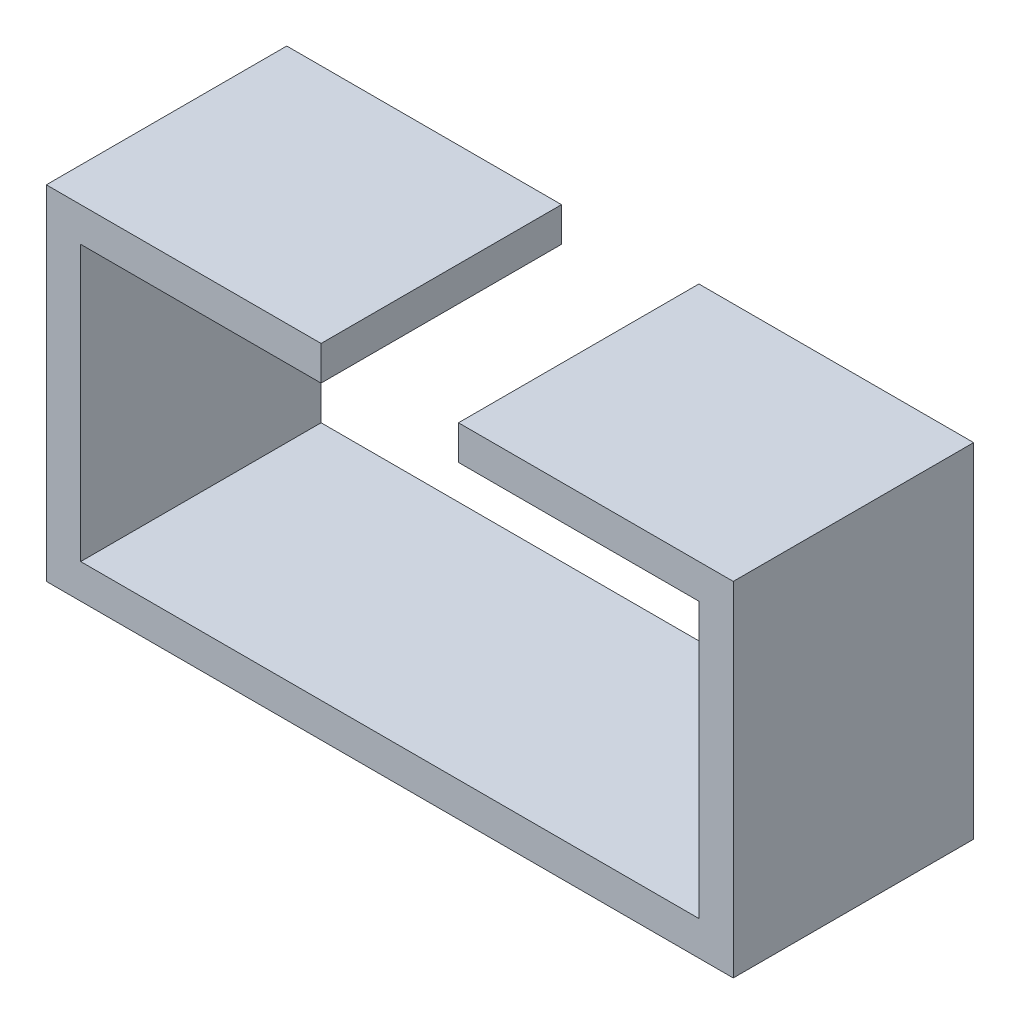
ISO-10303-21;
HEADER;
FILE_DESCRIPTION(('STEP AP214'),'2;1');
FILE_NAME('part.step','',(''),(''),'','','');
FILE_SCHEMA(('AUTOMOTIVE_DESIGN { 1 0 10303 214 1 1 1 1 }'));
ENDSEC;
DATA;
#1=APPLICATION_CONTEXT('core data for automotive mechanical design processes');
#2=APPLICATION_PROTOCOL_DEFINITION('international standard','automotive_design',2000,#1);
#3=PRODUCT_CONTEXT('',#1,'mechanical');
#4=PRODUCT('Part','Part','',(#3));
#5=PRODUCT_RELATED_PRODUCT_CATEGORY('part','',(#4));
#6=PRODUCT_DEFINITION_FORMATION('','',#4);
#7=PRODUCT_DEFINITION_CONTEXT('part definition',#1,'design');
#8=PRODUCT_DEFINITION('design','',#6,#7);
#9=PRODUCT_DEFINITION_SHAPE('','',#8);
#10=(LENGTH_UNIT() NAMED_UNIT(*) SI_UNIT(.MILLI.,.METRE.));
#11=(NAMED_UNIT(*) PLANE_ANGLE_UNIT() SI_UNIT($,.RADIAN.));
#12=(NAMED_UNIT(*) SI_UNIT($,.STERADIAN.) SOLID_ANGLE_UNIT());
#13=UNCERTAINTY_MEASURE_WITH_UNIT(LENGTH_MEASURE(1.E-05),#10,'distance_accuracy_value','');
#14=(GEOMETRIC_REPRESENTATION_CONTEXT(3) GLOBAL_UNCERTAINTY_ASSIGNED_CONTEXT((#13)) GLOBAL_UNIT_ASSIGNED_CONTEXT((#10,
#11,#12)) REPRESENTATION_CONTEXT('',''));
#15=CARTESIAN_POINT('',(0.,0.,0.));
#16=DIRECTION('',(0.,0.,1.));
#17=DIRECTION('',(1.,0.,0.));
#18=AXIS2_PLACEMENT_3D('',#15,#16,#17);
#19=CARTESIAN_POINT('',(-22.86,10.16,17.78));
#20=DIRECTION('',(-1.,0.,0.));
#21=DIRECTION('',(0.,0.,1.));
#22=AXIS2_PLACEMENT_3D('',#19,#20,#21);
#23=PLANE('',#22);
#24=DIRECTION('',(0.,1.,0.));
#25=VECTOR('',#24,1.);
#26=CARTESIAN_POINT('',(-22.86,10.16,0.));
#27=LINE('',#26,#25);
#28=CARTESIAN_POINT('',(-22.86,-10.16,0.));
#29=VERTEX_POINT('',#28);
#30=CARTESIAN_POINT('',(-22.86,10.16,0.));
#31=VERTEX_POINT('',#30);
#32=EDGE_CURVE('E164',#29,#31,#27,.T.);
#33=ORIENTED_EDGE('',*,*,#32,.T.);
#34=DIRECTION('',(0.,0.,-1.));
#35=VECTOR('',#34,1.);
#36=CARTESIAN_POINT('',(-22.86,10.16,17.78));
#37=LINE('',#36,#35);
#38=CARTESIAN_POINT('',(-22.86,10.16,17.78));
#39=VERTEX_POINT('',#38);
#40=EDGE_CURVE('E11',#39,#31,#37,.T.);
#41=ORIENTED_EDGE('',*,*,#40,.F.);
#42=DIRECTION('',(0.,1.,0.));
#43=VECTOR('',#42,1.);
#44=CARTESIAN_POINT('',(-22.86,10.16,17.78));
#45=LINE('',#44,#43);
#46=CARTESIAN_POINT('',(-22.86,-10.16,17.78));
#47=VERTEX_POINT('',#46);
#48=EDGE_CURVE('E198',#47,#39,#45,.T.);
#49=ORIENTED_EDGE('',*,*,#48,.F.);
#50=DIRECTION('',(0.,0.,-1.));
#51=VECTOR('',#50,1.);
#52=CARTESIAN_POINT('',(-22.86,-10.16,17.78));
#53=LINE('',#52,#51);
#54=EDGE_CURVE('E160',#47,#29,#53,.T.);
#55=ORIENTED_EDGE('',*,*,#54,.T.);
#56=EDGE_LOOP('',(#33,#41,#49,#55));
#57=FACE_BOUND('',#56,.T.);
#58=ADVANCED_FACE('F39',(#57),#23,.F.);
#59=CARTESIAN_POINT('',(-22.86,10.16,17.78));
#60=DIRECTION('',(0.,1.,0.));
#61=DIRECTION('',(0.,0.,1.));
#62=AXIS2_PLACEMENT_3D('',#59,#60,#61);
#63=PLANE('',#62);
#64=DIRECTION('',(1.,0.,0.));
#65=VECTOR('',#64,1.);
#66=CARTESIAN_POINT('',(-22.86,10.16,0.));
#67=LINE('',#66,#65);
#68=CARTESIAN_POINT('',(-5.08,10.16,0.));
#69=VERTEX_POINT('',#68);
#70=EDGE_CURVE('E168',#31,#69,#67,.T.);
#71=ORIENTED_EDGE('',*,*,#70,.T.);
#72=DIRECTION('',(0.,0.,-1.));
#73=VECTOR('',#72,1.);
#74=CARTESIAN_POINT('',(-5.08,10.16,17.78));
#75=LINE('',#74,#73);
#76=CARTESIAN_POINT('',(-5.08,10.16,17.78));
#77=VERTEX_POINT('',#76);
#78=EDGE_CURVE('E48',#77,#69,#75,.T.);
#79=ORIENTED_EDGE('',*,*,#78,.F.);
#80=DIRECTION('',(1.,0.,0.));
#81=VECTOR('',#80,1.);
#82=CARTESIAN_POINT('',(-22.86,10.16,17.78));
#83=LINE('',#82,#81);
#84=EDGE_CURVE('E111',#39,#77,#83,.T.);
#85=ORIENTED_EDGE('',*,*,#84,.F.);
#86=ORIENTED_EDGE('',*,*,#40,.T.);
#87=EDGE_LOOP('',(#71,#79,#85,#86));
#88=FACE_BOUND('',#87,.T.);
#89=ADVANCED_FACE('F292',(#88),#63,.F.);
#90=CARTESIAN_POINT('',(-5.08,12.7,17.78));
#91=DIRECTION('',(-1.,0.,0.));
#92=DIRECTION('',(0.,0.,1.));
#93=AXIS2_PLACEMENT_3D('',#90,#91,#92);
#94=PLANE('',#93);
#95=DIRECTION('',(0.,1.,0.));
#96=VECTOR('',#95,1.);
#97=CARTESIAN_POINT('',(-5.08,12.7,0.));
#98=LINE('',#97,#96);
#99=CARTESIAN_POINT('',(-5.08,12.7,0.));
#100=VERTEX_POINT('',#99);
#101=EDGE_CURVE('E171',#69,#100,#98,.T.);
#102=ORIENTED_EDGE('',*,*,#101,.T.);
#103=DIRECTION('',(0.,0.,-1.));
#104=VECTOR('',#103,1.);
#105=CARTESIAN_POINT('',(-5.08,12.7,17.78));
#106=LINE('',#105,#104);
#107=CARTESIAN_POINT('',(-5.08,12.7,17.78));
#108=VERTEX_POINT('',#107);
#109=EDGE_CURVE('E225',#108,#100,#106,.T.);
#110=ORIENTED_EDGE('',*,*,#109,.F.);
#111=DIRECTION('',(0.,1.,0.));
#112=VECTOR('',#111,1.);
#113=CARTESIAN_POINT('',(-5.08,12.7,17.78));
#114=LINE('',#113,#112);
#115=EDGE_CURVE('E235',#77,#108,#114,.T.);
#116=ORIENTED_EDGE('',*,*,#115,.F.);
#117=ORIENTED_EDGE('',*,*,#78,.T.);
#118=EDGE_LOOP('',(#102,#110,#116,#117));
#119=FACE_BOUND('',#118,.T.);
#120=ADVANCED_FACE('F233',(#119),#94,.F.);
#121=CARTESIAN_POINT('',(-5.08,12.7,17.78));
#122=DIRECTION('',(0.,-1.,0.));
#123=DIRECTION('',(1.,0.,0.));
#124=AXIS2_PLACEMENT_3D('',#121,#122,#123);
#125=PLANE('',#124);
#126=DIRECTION('',(-1.,0.,0.));
#127=VECTOR('',#126,1.);
#128=CARTESIAN_POINT('',(-5.08,12.7,0.));
#129=LINE('',#128,#127);
#130=CARTESIAN_POINT('',(-25.4,12.7,0.));
#131=VERTEX_POINT('',#130);
#132=EDGE_CURVE('E174',#100,#131,#129,.T.);
#133=ORIENTED_EDGE('',*,*,#132,.T.);
#134=DIRECTION('',(0.,0.,-1.));
#135=VECTOR('',#134,1.);
#136=CARTESIAN_POINT('',(-25.4,12.7,17.78));
#137=LINE('',#136,#135);
#138=CARTESIAN_POINT('',(-25.4,12.7,17.78));
#139=VERTEX_POINT('',#138);
#140=EDGE_CURVE('E221',#139,#131,#137,.T.);
#141=ORIENTED_EDGE('',*,*,#140,.F.);
#142=DIRECTION('',(-1.,0.,0.));
#143=VECTOR('',#142,1.);
#144=CARTESIAN_POINT('',(-5.08,12.7,17.78));
#145=LINE('',#144,#143);
#146=EDGE_CURVE('E254',#108,#139,#145,.T.);
#147=ORIENTED_EDGE('',*,*,#146,.F.);
#148=ORIENTED_EDGE('',*,*,#109,.T.);
#149=EDGE_LOOP('',(#133,#141,#147,#148));
#150=FACE_BOUND('',#149,.T.);
#151=ADVANCED_FACE('F244',(#150),#125,.F.);
#152=CARTESIAN_POINT('',(-25.4,12.7,17.78));
#153=DIRECTION('',(1.,0.,0.));
#154=DIRECTION('',(0.,0.,-1.));
#155=AXIS2_PLACEMENT_3D('',#152,#153,#154);
#156=PLANE('',#155);
#157=DIRECTION('',(0.,-1.,0.));
#158=VECTOR('',#157,1.);
#159=CARTESIAN_POINT('',(-25.4,12.7,0.));
#160=LINE('',#159,#158);
#161=CARTESIAN_POINT('',(-25.4,-12.7,0.));
#162=VERTEX_POINT('',#161);
#163=EDGE_CURVE('E177',#131,#162,#160,.T.);
#164=ORIENTED_EDGE('',*,*,#163,.T.);
#165=DIRECTION('',(0.,0.,-1.));
#166=VECTOR('',#165,1.);
#167=CARTESIAN_POINT('',(-25.4,-12.7,17.78));
#168=LINE('',#167,#166);
#169=CARTESIAN_POINT('',(-25.4,-12.7,17.78));
#170=VERTEX_POINT('',#169);
#171=EDGE_CURVE('E217',#170,#162,#168,.T.);
#172=ORIENTED_EDGE('',*,*,#171,.F.);
#173=DIRECTION('',(0.,-1.,0.));
#174=VECTOR('',#173,1.);
#175=CARTESIAN_POINT('',(-25.4,12.7,17.78));
#176=LINE('',#175,#174);
#177=EDGE_CURVE('E250',#139,#170,#176,.T.);
#178=ORIENTED_EDGE('',*,*,#177,.F.);
#179=ORIENTED_EDGE('',*,*,#140,.T.);
#180=EDGE_LOOP('',(#164,#172,#178,#179));
#181=FACE_BOUND('',#180,.T.);
#182=ADVANCED_FACE('F248',(#181),#156,.F.);
#183=CARTESIAN_POINT('',(25.4,-12.7,17.78));
#184=DIRECTION('',(0.,1.,0.));
#185=DIRECTION('',(0.,0.,1.));
#186=AXIS2_PLACEMENT_3D('',#183,#184,#185);
#187=PLANE('',#186);
#188=DIRECTION('',(1.,0.,0.));
#189=VECTOR('',#188,1.);
#190=CARTESIAN_POINT('',(25.4,-12.7,0.));
#191=LINE('',#190,#189);
#192=CARTESIAN_POINT('',(25.4,-12.7,0.));
#193=VERTEX_POINT('',#192);
#194=EDGE_CURVE('E180',#162,#193,#191,.T.);
#195=ORIENTED_EDGE('',*,*,#194,.T.);
#196=DIRECTION('',(0.,0.,-1.));
#197=VECTOR('',#196,1.);
#198=CARTESIAN_POINT('',(25.4,-12.7,17.78));
#199=LINE('',#198,#197);
#200=CARTESIAN_POINT('',(25.4,-12.7,17.78));
#201=VERTEX_POINT('',#200);
#202=EDGE_CURVE('E213',#201,#193,#199,.T.);
#203=ORIENTED_EDGE('',*,*,#202,.F.);
#204=DIRECTION('',(1.,0.,0.));
#205=VECTOR('',#204,1.);
#206=CARTESIAN_POINT('',(25.4,-12.7,17.78));
#207=LINE('',#206,#205);
#208=EDGE_CURVE('E253',#170,#201,#207,.T.);
#209=ORIENTED_EDGE('',*,*,#208,.F.);
#210=ORIENTED_EDGE('',*,*,#171,.T.);
#211=EDGE_LOOP('',(#195,#203,#209,#210));
#212=FACE_BOUND('',#211,.T.);
#213=ADVANCED_FACE('F305',(#212),#187,.F.);
#214=CARTESIAN_POINT('',(25.4,12.7,17.78));
#215=DIRECTION('',(-1.,0.,0.));
#216=DIRECTION('',(0.,0.,1.));
#217=AXIS2_PLACEMENT_3D('',#214,#215,#216);
#218=PLANE('',#217);
#219=DIRECTION('',(0.,1.,0.));
#220=VECTOR('',#219,1.);
#221=CARTESIAN_POINT('',(25.4,12.7,0.));
#222=LINE('',#221,#220);
#223=CARTESIAN_POINT('',(25.4,12.7,0.));
#224=VERTEX_POINT('',#223);
#225=EDGE_CURVE('E183',#193,#224,#222,.T.);
#226=ORIENTED_EDGE('',*,*,#225,.T.);
#227=DIRECTION('',(0.,0.,-1.));
#228=VECTOR('',#227,1.);
#229=CARTESIAN_POINT('',(25.4,12.7,17.78));
#230=LINE('',#229,#228);
#231=CARTESIAN_POINT('',(25.4,12.7,17.78));
#232=VERTEX_POINT('',#231);
#233=EDGE_CURVE('E209',#232,#224,#230,.T.);
#234=ORIENTED_EDGE('',*,*,#233,.F.);
#235=DIRECTION('',(0.,1.,0.));
#236=VECTOR('',#235,1.);
#237=CARTESIAN_POINT('',(25.4,12.7,17.78));
#238=LINE('',#237,#236);
#239=EDGE_CURVE('E258',#201,#232,#238,.T.);
#240=ORIENTED_EDGE('',*,*,#239,.F.);
#241=ORIENTED_EDGE('',*,*,#202,.T.);
#242=EDGE_LOOP('',(#226,#234,#240,#241));
#243=FACE_BOUND('',#242,.T.);
#244=ADVANCED_FACE('F308',(#243),#218,.F.);
#245=CARTESIAN_POINT('',(25.4,12.7,17.78));
#246=DIRECTION('',(0.,-1.,0.));
#247=DIRECTION('',(1.,0.,0.));
#248=AXIS2_PLACEMENT_3D('',#245,#246,#247);
#249=PLANE('',#248);
#250=DIRECTION('',(-1.,0.,0.));
#251=VECTOR('',#250,1.);
#252=CARTESIAN_POINT('',(25.4,12.7,0.));
#253=LINE('',#252,#251);
#254=CARTESIAN_POINT('',(5.08,12.7,0.));
#255=VERTEX_POINT('',#254);
#256=EDGE_CURVE('E186',#224,#255,#253,.T.);
#257=ORIENTED_EDGE('',*,*,#256,.T.);
#258=DIRECTION('',(0.,0.,-1.));
#259=VECTOR('',#258,1.);
#260=CARTESIAN_POINT('',(5.08,12.7,17.78));
#261=LINE('',#260,#259);
#262=CARTESIAN_POINT('',(5.08,12.7,17.78));
#263=VERTEX_POINT('',#262);
#264=EDGE_CURVE('E205',#263,#255,#261,.T.);
#265=ORIENTED_EDGE('',*,*,#264,.F.);
#266=DIRECTION('',(-1.,0.,0.));
#267=VECTOR('',#266,1.);
#268=CARTESIAN_POINT('',(25.4,12.7,17.78));
#269=LINE('',#268,#267);
#270=EDGE_CURVE('E265',#232,#263,#269,.T.);
#271=ORIENTED_EDGE('',*,*,#270,.F.);
#272=ORIENTED_EDGE('',*,*,#233,.T.);
#273=EDGE_LOOP('',(#257,#265,#271,#272));
#274=FACE_BOUND('',#273,.T.);
#275=ADVANCED_FACE('F273',(#274),#249,.F.);
#276=CARTESIAN_POINT('',(5.08,12.7,17.78));
#277=DIRECTION('',(1.,0.,0.));
#278=DIRECTION('',(0.,0.,-1.));
#279=AXIS2_PLACEMENT_3D('',#276,#277,#278);
#280=PLANE('',#279);
#281=DIRECTION('',(0.,-1.,0.));
#282=VECTOR('',#281,1.);
#283=CARTESIAN_POINT('',(5.08,12.7,0.));
#284=LINE('',#283,#282);
#285=CARTESIAN_POINT('',(5.08,10.16,0.));
#286=VERTEX_POINT('',#285);
#287=EDGE_CURVE('E189',#255,#286,#284,.T.);
#288=ORIENTED_EDGE('',*,*,#287,.T.);
#289=DIRECTION('',(0.,0.,-1.));
#290=VECTOR('',#289,1.);
#291=CARTESIAN_POINT('',(5.08,10.16,17.78));
#292=LINE('',#291,#290);
#293=CARTESIAN_POINT('',(5.08,10.16,17.78));
#294=VERTEX_POINT('',#293);
#295=EDGE_CURVE('E153',#294,#286,#292,.T.);
#296=ORIENTED_EDGE('',*,*,#295,.F.);
#297=DIRECTION('',(0.,-1.,0.));
#298=VECTOR('',#297,1.);
#299=CARTESIAN_POINT('',(5.08,12.7,17.78));
#300=LINE('',#299,#298);
#301=EDGE_CURVE('E142',#263,#294,#300,.T.);
#302=ORIENTED_EDGE('',*,*,#301,.F.);
#303=ORIENTED_EDGE('',*,*,#264,.T.);
#304=EDGE_LOOP('',(#288,#296,#302,#303));
#305=FACE_BOUND('',#304,.T.);
#306=ADVANCED_FACE('F277',(#305),#280,.F.);
#307=CARTESIAN_POINT('',(5.08,10.16,17.78));
#308=DIRECTION('',(0.,1.,0.));
#309=DIRECTION('',(-1.,0.,0.));
#310=AXIS2_PLACEMENT_3D('',#307,#308,#309);
#311=PLANE('',#310);
#312=DIRECTION('',(1.,0.,0.));
#313=VECTOR('',#312,1.);
#314=CARTESIAN_POINT('',(5.08,10.16,0.));
#315=LINE('',#314,#313);
#316=CARTESIAN_POINT('',(22.86,10.16,0.));
#317=VERTEX_POINT('',#316);
#318=EDGE_CURVE('E151',#286,#317,#315,.T.);
#319=ORIENTED_EDGE('',*,*,#318,.T.);
#320=DIRECTION('',(0.,0.,-1.));
#321=VECTOR('',#320,1.);
#322=CARTESIAN_POINT('',(22.86,10.16,17.78));
#323=LINE('',#322,#321);
#324=CARTESIAN_POINT('',(22.86,10.16,17.78));
#325=VERTEX_POINT('',#324);
#326=EDGE_CURVE('E148',#325,#317,#323,.T.);
#327=ORIENTED_EDGE('',*,*,#326,.F.);
#328=DIRECTION('',(1.,0.,0.));
#329=VECTOR('',#328,1.);
#330=CARTESIAN_POINT('',(5.08,10.16,17.78));
#331=LINE('',#330,#329);
#332=EDGE_CURVE('E136',#294,#325,#331,.T.);
#333=ORIENTED_EDGE('',*,*,#332,.F.);
#334=ORIENTED_EDGE('',*,*,#295,.T.);
#335=EDGE_LOOP('',(#319,#327,#333,#334));
#336=FACE_BOUND('',#335,.T.);
#337=ADVANCED_FACE('F149',(#336),#311,.F.);
#338=CARTESIAN_POINT('',(22.86,10.16,17.78));
#339=DIRECTION('',(1.,0.,0.));
#340=DIRECTION('',(0.,0.,-1.));
#341=AXIS2_PLACEMENT_3D('',#338,#339,#340);
#342=PLANE('',#341);
#343=DIRECTION('',(0.,-1.,0.));
#344=VECTOR('',#343,1.);
#345=CARTESIAN_POINT('',(22.86,10.16,0.));
#346=LINE('',#345,#344);
#347=CARTESIAN_POINT('',(22.86,-10.16,0.));
#348=VERTEX_POINT('',#347);
#349=EDGE_CURVE('E97',#317,#348,#346,.T.);
#350=ORIENTED_EDGE('',*,*,#349,.T.);
#351=DIRECTION('',(0.,0.,-1.));
#352=VECTOR('',#351,1.);
#353=CARTESIAN_POINT('',(22.86,-10.16,17.78));
#354=LINE('',#353,#352);
#355=CARTESIAN_POINT('',(22.86,-10.16,17.78));
#356=VERTEX_POINT('',#355);
#357=EDGE_CURVE('E154',#356,#348,#354,.T.);
#358=ORIENTED_EDGE('',*,*,#357,.F.);
#359=DIRECTION('',(0.,-1.,0.));
#360=VECTOR('',#359,1.);
#361=CARTESIAN_POINT('',(22.86,10.16,17.78));
#362=LINE('',#361,#360);
#363=EDGE_CURVE('E140',#325,#356,#362,.T.);
#364=ORIENTED_EDGE('',*,*,#363,.F.);
#365=ORIENTED_EDGE('',*,*,#326,.T.);
#366=EDGE_LOOP('',(#350,#358,#364,#365));
#367=FACE_BOUND('',#366,.T.);
#368=ADVANCED_FACE('F156',(#367),#342,.F.);
#369=CARTESIAN_POINT('',(-22.86,-10.16,17.78));
#370=DIRECTION('',(0.,-1.,0.));
#371=DIRECTION('',(0.,0.,-1.));
#372=AXIS2_PLACEMENT_3D('',#369,#370,#371);
#373=PLANE('',#372);
#374=DIRECTION('',(-1.,0.,0.));
#375=VECTOR('',#374,1.);
#376=CARTESIAN_POINT('',(-22.86,-10.16,0.));
#377=LINE('',#376,#375);
#378=EDGE_CURVE('E103',#348,#29,#377,.T.);
#379=ORIENTED_EDGE('',*,*,#378,.T.);
#380=ORIENTED_EDGE('',*,*,#54,.F.);
#381=DIRECTION('',(-1.,0.,0.));
#382=VECTOR('',#381,1.);
#383=CARTESIAN_POINT('',(-22.86,-10.16,17.78));
#384=LINE('',#383,#382);
#385=EDGE_CURVE('E56',#356,#47,#384,.T.);
#386=ORIENTED_EDGE('',*,*,#385,.F.);
#387=ORIENTED_EDGE('',*,*,#357,.T.);
#388=EDGE_LOOP('',(#379,#380,#386,#387));
#389=FACE_BOUND('',#388,.T.);
#390=ADVANCED_FACE('F281',(#389),#373,.F.);
#391=CARTESIAN_POINT('',(0.,0.,17.78));
#392=DIRECTION('',(0.,0.,1.));
#393=DIRECTION('',(1.,0.,0.));
#394=AXIS2_PLACEMENT_3D('',#391,#392,#393);
#395=PLANE('',#394);
#396=ORIENTED_EDGE('',*,*,#48,.T.);
#397=ORIENTED_EDGE('',*,*,#84,.T.);
#398=ORIENTED_EDGE('',*,*,#115,.T.);
#399=ORIENTED_EDGE('',*,*,#146,.T.);
#400=ORIENTED_EDGE('',*,*,#177,.T.);
#401=ORIENTED_EDGE('',*,*,#208,.T.);
#402=ORIENTED_EDGE('',*,*,#239,.T.);
#403=ORIENTED_EDGE('',*,*,#270,.T.);
#404=ORIENTED_EDGE('',*,*,#301,.T.);
#405=ORIENTED_EDGE('',*,*,#332,.T.);
#406=ORIENTED_EDGE('',*,*,#363,.T.);
#407=ORIENTED_EDGE('',*,*,#385,.T.);
#408=EDGE_LOOP('',(#396,#397,#398,#399,#400,#401,#402,#403,#404,#405,#406,#407));
#409=FACE_BOUND('',#408,.T.);
#410=ADVANCED_FACE('F138',(#409),#395,.T.);
#411=CARTESIAN_POINT('',(0.,0.,0.));
#412=DIRECTION('',(0.,0.,1.));
#413=DIRECTION('',(1.,0.,0.));
#414=AXIS2_PLACEMENT_3D('',#411,#412,#413);
#415=PLANE('',#414);
#416=ORIENTED_EDGE('',*,*,#32,.F.);
#417=ORIENTED_EDGE('',*,*,#378,.F.);
#418=ORIENTED_EDGE('',*,*,#349,.F.);
#419=ORIENTED_EDGE('',*,*,#318,.F.);
#420=ORIENTED_EDGE('',*,*,#287,.F.);
#421=ORIENTED_EDGE('',*,*,#256,.F.);
#422=ORIENTED_EDGE('',*,*,#225,.F.);
#423=ORIENTED_EDGE('',*,*,#194,.F.);
#424=ORIENTED_EDGE('',*,*,#163,.F.);
#425=ORIENTED_EDGE('',*,*,#132,.F.);
#426=ORIENTED_EDGE('',*,*,#101,.F.);
#427=ORIENTED_EDGE('',*,*,#70,.F.);
#428=EDGE_LOOP('',(#416,#417,#418,#419,#420,#421,#422,#423,#424,#425,#426,#427));
#429=FACE_BOUND('',#428,.T.);
#430=ADVANCED_FACE('F239',(#429),#415,.F.);
#431=CLOSED_SHELL('',(#58,#89,#120,#151,#182,#213,#244,#275,#306,#337,#368,#390,#410,#430));
#432=MANIFOLD_SOLID_BREP('B2',#431);
#433=ADVANCED_BREP_SHAPE_REPRESENTATION('',(#18,#432),#14);
#434=SHAPE_DEFINITION_REPRESENTATION(#9,#433);
ENDSEC;
END-ISO-10303-21;
